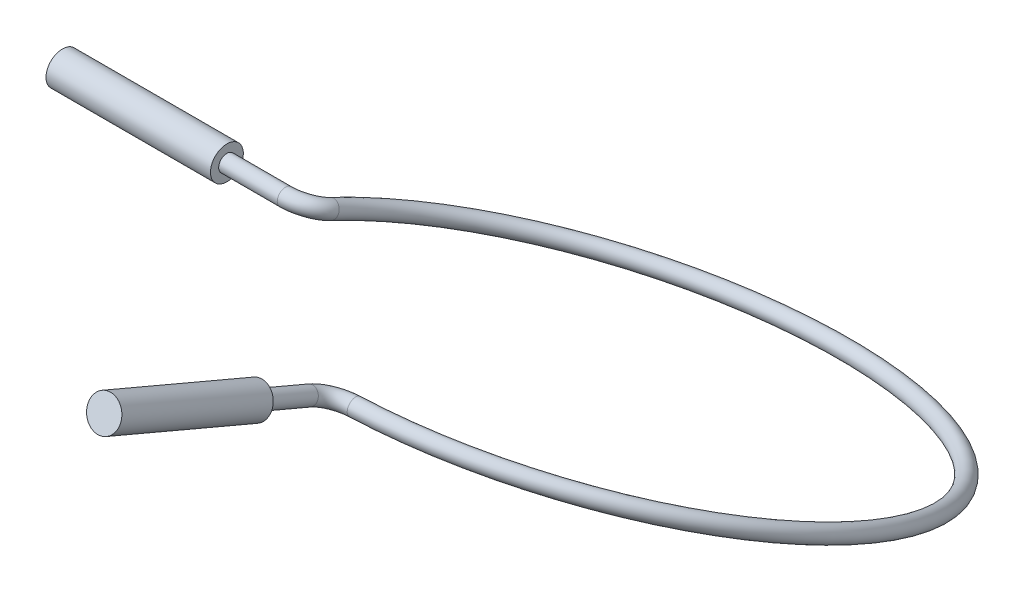
ISO-10303-21;
HEADER;
FILE_DESCRIPTION(('STEP AP214'),'2;1');
FILE_NAME('part.step','',(''),(''),'','','');
FILE_SCHEMA(('AUTOMOTIVE_DESIGN { 1 0 10303 214 1 1 1 1 }'));
ENDSEC;
DATA;
#1=APPLICATION_CONTEXT('core data for automotive mechanical design processes');
#2=APPLICATION_PROTOCOL_DEFINITION('international standard','automotive_design',2000,#1);
#3=PRODUCT_CONTEXT('',#1,'mechanical');
#4=PRODUCT('Part','Part','',(#3));
#5=PRODUCT_RELATED_PRODUCT_CATEGORY('part','',(#4));
#6=PRODUCT_DEFINITION_FORMATION('','',#4);
#7=PRODUCT_DEFINITION_CONTEXT('part definition',#1,'design');
#8=PRODUCT_DEFINITION('design','',#6,#7);
#9=PRODUCT_DEFINITION_SHAPE('','',#8);
#10=(LENGTH_UNIT() NAMED_UNIT(*) SI_UNIT(.MILLI.,.METRE.));
#11=(NAMED_UNIT(*) PLANE_ANGLE_UNIT() SI_UNIT($,.RADIAN.));
#12=(NAMED_UNIT(*) SI_UNIT($,.STERADIAN.) SOLID_ANGLE_UNIT());
#13=UNCERTAINTY_MEASURE_WITH_UNIT(LENGTH_MEASURE(1.E-05),#10,'distance_accuracy_value','');
#14=(GEOMETRIC_REPRESENTATION_CONTEXT(3) GLOBAL_UNCERTAINTY_ASSIGNED_CONTEXT((#13)) GLOBAL_UNIT_ASSIGNED_CONTEXT((#10,
#11,#12)) REPRESENTATION_CONTEXT('',''));
#15=CARTESIAN_POINT('',(0.,0.,0.));
#16=DIRECTION('',(0.,0.,1.));
#17=DIRECTION('',(1.,0.,0.));
#18=AXIS2_PLACEMENT_3D('',#15,#16,#17);
#19=CARTESIAN_POINT('',(-36.7708609577545,-92.2167493659821,300.912723344593));
#20=DIRECTION('',(-1.,0.,0.));
#21=DIRECTION('',(0.,0.,1.));
#22=AXIS2_PLACEMENT_3D('',#19,#20,#21);
#23=CYLINDRICAL_SURFACE('',#22,1.);
#24=CARTESIAN_POINT('',(-36.7708609577544,-92.2167493659821,300.912723344593));
#25=DIRECTION('',(1.,0.,0.));
#26=DIRECTION('',(0.,0.,-1.));
#27=AXIS2_PLACEMENT_3D('',#24,#25,#26);
#28=CIRCLE('',#27,1.);
#29=CARTESIAN_POINT('',(-36.7708609577543,-91.8260182374928,301.833228198046));
#30=VERTEX_POINT('',#29);
#31=EDGE_CURVE('E50',#30,#30,#28,.T.);
#32=ORIENTED_EDGE('',*,*,#31,.F.);
#33=EDGE_LOOP('',(#32));
#34=FACE_BOUND('',#33,.T.);
#35=CARTESIAN_POINT('',(-43.8930374945532,-92.2167493659821,300.912723344593));
#36=DIRECTION('',(-1.,0.,0.));
#37=DIRECTION('',(0.,0.,1.));
#38=AXIS2_PLACEMENT_3D('',#35,#36,#37);
#39=CIRCLE('',#38,1.);
#40=CARTESIAN_POINT('',(-43.8930374945532,-92.2167493659821,301.912723344593));
#41=VERTEX_POINT('',#40);
#42=EDGE_CURVE('E10',#41,#41,#39,.T.);
#43=ORIENTED_EDGE('',*,*,#42,.F.);
#44=EDGE_LOOP('',(#43));
#45=FACE_BOUND('',#44,.T.);
#46=ADVANCED_FACE('F39',(#34,#45),#23,.T.);
#47=CARTESIAN_POINT('',(-1.38777878078145E-13,-67.2517507231281,359.726574460148));
#48=DIRECTION('',(0.,-0.390731128489272,-0.920504853452441));
#49=DIRECTION('',(0.,0.920504853452441,-0.390731128489272));
#50=AXIS2_PLACEMENT_3D('',#47,#48,#49);
#51=CYLINDRICAL_SURFACE('',#50,1.);
#52=CARTESIAN_POINT('',(-2.77555756156289E-13,-77.8492293684367,334.760479321831));
#53=DIRECTION('',(0.,0.390731128489272,0.920504853452441));
#54=DIRECTION('',(0.920504853452441,0.359669900169322,-0.152670814770504));
#55=AXIS2_PLACEMENT_3D('',#52,#53,#54);
#56=CIRCLE('',#55,1.);
#57=CARTESIAN_POINT('',(-1.00000000000028,-77.8492293684368,334.760479321831));
#58=VERTEX_POINT('',#57);
#59=EDGE_CURVE('E62',#58,#58,#56,.T.);
#60=ORIENTED_EDGE('',*,*,#59,.T.);
#61=EDGE_LOOP('',(#60));
#62=FACE_BOUND('',#61,.T.);
#63=CARTESIAN_POINT('',(-2.41185599609037E-13,-75.0663732929135,341.316477391099));
#64=DIRECTION('',(0.,0.390731128489272,0.920504853452441));
#65=DIRECTION('',(0.,-0.920504853452441,0.390731128489272));
#66=AXIS2_PLACEMENT_3D('',#63,#64,#65);
#67=CIRCLE('',#66,1.);
#68=CARTESIAN_POINT('',(-2.41185599609037E-13,-75.986878146366,341.707208519588));
#69=VERTEX_POINT('',#68);
#70=EDGE_CURVE('E46',#69,#69,#67,.T.);
#71=ORIENTED_EDGE('',*,*,#70,.F.);
#72=EDGE_LOOP('',(#71));
#73=FACE_BOUND('',#72,.T.);
#74=ADVANCED_FACE('F94',(#62,#73),#51,.T.);
#75=CARTESIAN_POINT('',(2.99999999999975,-77.8492293684367,334.760479321831));
#76=DIRECTION('',(0.,-0.920504853452441,0.390731128489272));
#77=DIRECTION('',(0.,-0.390731128489272,-0.920504853452441));
#78=AXIS2_PLACEMENT_3D('',#75,#76,#77);
#79=TOROIDAL_SURFACE('',#78,3.00000000000003,1.);
#80=CARTESIAN_POINT('',(2.75605153136717,-79.0175408689198,332.008109909399));
#81=DIRECTION('',(-0.996688357882789,0.0317727534806798,0.0748519164561933));
#82=DIRECTION('',(0.0748519164561938,0.718148702348954,0.691852319442053));
#83=AXIS2_PLACEMENT_3D('',#80,#81,#82);
#84=CIRCLE('',#83,1.);
#85=CARTESIAN_POINT('',(2.67473537515632,-79.4069780357474,331.090653438588));
#86=VERTEX_POINT('',#85);
#87=EDGE_CURVE('E59',#86,#86,#84,.T.);
#88=CARTESIAN_POINT('',(2.99999999999975,-77.8492293684367,334.760479321831));
#89=DIRECTION('',(0.,-0.920504853452441,0.390731128489272));
#90=DIRECTION('',(0.,-0.390731128489272,-0.920504853452441));
#91=AXIS2_PLACEMENT_3D('',#88,#89,#90);
#92=CIRCLE('',#91,4.00000000000003);
#93=EDGE_CURVE('',#58,#86,#92,.T.);
#94=ORIENTED_EDGE('',*,*,#59,.F.);
#95=ORIENTED_EDGE('',*,*,#87,.T.);
#96=ORIENTED_EDGE('',*,*,#93,.T.);
#97=ORIENTED_EDGE('',*,*,#93,.F.);
#98=EDGE_LOOP('',(#94,#96,#95,#97));
#99=FACE_BOUND('',#98,.T.);
#100=ADVANCED_FACE('F101',(#99),#79,.T.);
#101=CARTESIAN_POINT('',(-4.16767315103428E-13,-92.2167493659821,300.912723344593));
#102=DIRECTION('',(0.,0.920504853452441,-0.390731128489272));
#103=DIRECTION('',(0.,0.390731128489272,0.920504853452441));
#104=AXIS2_PLACEMENT_3D('',#101,#102,#103);
#105=TOROIDAL_SURFACE('',#104,33.8930374945528,1.);
#106=CARTESIAN_POINT('',(-33.7807958841061,-93.2936244910079,298.375764533604));
#107=DIRECTION('',(0.0813161562108567,-0.389437166827661,-0.917456470810651));
#108=DIRECTION('',(-0.917456470810651,0.330422926382812,-0.22157236715864));
#109=AXIS2_PLACEMENT_3D('',#106,#107,#108);
#110=CIRCLE('',#109,1.);
#111=CARTESIAN_POINT('',(-32.7841075262233,-93.2618517375272,298.45061645006));
#112=VERTEX_POINT('',#111);
#113=EDGE_CURVE('E54',#112,#112,#110,.T.);
#114=ORIENTED_EDGE('',*,*,#113,.T.);
#115=EDGE_LOOP('',(#114));
#116=FACE_BOUND('',#115,.T.);
#117=ORIENTED_EDGE('',*,*,#87,.F.);
#118=EDGE_LOOP('',(#117));
#119=FACE_BOUND('',#118,.T.);
#120=ADVANCED_FACE('F111',(#116,#119),#105,.T.);
#121=CARTESIAN_POINT('',(-36.7708609577545,-93.3889427514499,298.151208784236));
#122=DIRECTION('',(0.,-0.920504853452441,0.390731128489272));
#123=DIRECTION('',(0.,-0.390731128489272,-0.920504853452441));
#124=AXIS2_PLACEMENT_3D('',#121,#122,#123);
#125=TOROIDAL_SURFACE('',#124,3.00000000000001,1.);
#126=CARTESIAN_POINT('',(-36.7708609577545,-93.3889427514499,298.151208784236));
#127=DIRECTION('',(0.,-0.920504853452441,0.390731128489272));
#128=DIRECTION('',(0.,-0.390731128489272,-0.920504853452441));
#129=AXIS2_PLACEMENT_3D('',#126,#127,#128);
#130=CIRCLE('',#129,4.00000000000001);
#131=EDGE_CURVE('',#112,#30,#130,.T.);
#132=ORIENTED_EDGE('',*,*,#113,.F.);
#133=ORIENTED_EDGE('',*,*,#31,.T.);
#134=ORIENTED_EDGE('',*,*,#131,.T.);
#135=ORIENTED_EDGE('',*,*,#131,.F.);
#136=EDGE_LOOP('',(#132,#134,#133,#135));
#137=FACE_BOUND('',#136,.T.);
#138=ADVANCED_FACE('F104',(#137),#125,.T.);
#139=CARTESIAN_POINT('',(-2.41185599609037E-13,-75.0663732929136,341.316477391099));
#140=DIRECTION('',(0.,0.390731128489272,0.920504853452441));
#141=DIRECTION('',(0.,-0.920504853452441,0.390731128489272));
#142=AXIS2_PLACEMENT_3D('',#139,#140,#141);
#143=CYLINDRICAL_SURFACE('',#142,2.);
#144=CARTESIAN_POINT('',(-2.41185599609037E-13,-75.0663732929136,341.316477391099));
#145=DIRECTION('',(0.,0.390731128489272,0.920504853452441));
#146=DIRECTION('',(1.,0.,0.));
#147=AXIS2_PLACEMENT_3D('',#144,#145,#146);
#148=CIRCLE('',#147,2.);
#149=CARTESIAN_POINT('',(1.99999999999976,-75.0663732929136,341.316477391099));
#150=VERTEX_POINT('',#149);
#151=EDGE_CURVE('E65',#150,#150,#148,.T.);
#152=ORIENTED_EDGE('',*,*,#151,.T.);
#153=EDGE_LOOP('',(#152));
#154=FACE_BOUND('',#153,.T.);
#155=CARTESIAN_POINT('',(-1.38777878078144E-13,-67.2517507231282,359.726574460148));
#156=DIRECTION('',(0.,0.390731128489272,0.920504853452441));
#157=DIRECTION('',(1.,0.,0.));
#158=AXIS2_PLACEMENT_3D('',#155,#156,#157);
#159=CIRCLE('',#158,2.);
#160=CARTESIAN_POINT('',(1.99999999999986,-67.2517507231282,359.726574460148));
#161=VERTEX_POINT('',#160);
#162=EDGE_CURVE('E66',#161,#161,#159,.T.);
#163=ORIENTED_EDGE('',*,*,#162,.F.);
#164=EDGE_LOOP('',(#163));
#165=FACE_BOUND('',#164,.T.);
#166=ADVANCED_FACE('F110',(#154,#165),#143,.T.);
#167=CARTESIAN_POINT('',(-2.41185599609037E-13,-75.0663732929136,341.316477391099));
#168=DIRECTION('',(0.,0.390731128489272,0.920504853452441));
#169=DIRECTION('',(0.,-0.920504853452441,0.390731128489272));
#170=AXIS2_PLACEMENT_3D('',#167,#168,#169);
#171=PLANE('',#170);
#172=ORIENTED_EDGE('',*,*,#70,.T.);
#173=EDGE_LOOP('',(#172));
#174=FACE_BOUND('',#173,.T.);
#175=ORIENTED_EDGE('',*,*,#151,.F.);
#176=EDGE_LOOP('',(#175));
#177=FACE_BOUND('',#176,.T.);
#178=ADVANCED_FACE('F121',(#174,#177),#171,.F.);
#179=CARTESIAN_POINT('',(-1.38777878078145E-13,-67.2517507231281,359.726574460148));
#180=DIRECTION('',(0.,0.390731128489272,0.920504853452441));
#181=DIRECTION('',(0.920504853452441,0.359669900169322,-0.152670814770504));
#182=AXIS2_PLACEMENT_3D('',#179,#180,#181);
#183=PLANE('',#182);
#184=ORIENTED_EDGE('',*,*,#162,.T.);
#185=EDGE_LOOP('',(#184));
#186=FACE_BOUND('',#185,.T.);
#187=ADVANCED_FACE('F41',(#186),#183,.T.);
#188=CARTESIAN_POINT('',(-43.8930374945532,-92.2167493659821,300.912723344593));
#189=DIRECTION('',(-1.,0.,0.));
#190=DIRECTION('',(0.,0.,1.));
#191=AXIS2_PLACEMENT_3D('',#188,#189,#190);
#192=CYLINDRICAL_SURFACE('',#191,2.);
#193=CARTESIAN_POINT('',(-43.8930374945532,-92.2167493659821,300.912723344593));
#194=DIRECTION('',(-1.,0.,0.));
#195=DIRECTION('',(0.,0.,1.));
#196=AXIS2_PLACEMENT_3D('',#193,#194,#195);
#197=CIRCLE('',#196,2.);
#198=CARTESIAN_POINT('',(-43.8930374945532,-92.2167493659821,302.912723344593));
#199=VERTEX_POINT('',#198);
#200=EDGE_CURVE('E69',#199,#199,#197,.T.);
#201=ORIENTED_EDGE('',*,*,#200,.T.);
#202=EDGE_LOOP('',(#201));
#203=FACE_BOUND('',#202,.T.);
#204=CARTESIAN_POINT('',(-63.8930374945532,-92.2167493659821,300.912723344593));
#205=DIRECTION('',(-1.,0.,0.));
#206=DIRECTION('',(0.,0.,1.));
#207=AXIS2_PLACEMENT_3D('',#204,#205,#206);
#208=CIRCLE('',#207,2.);
#209=CARTESIAN_POINT('',(-63.8930374945532,-92.2167493659821,302.912723344593));
#210=VERTEX_POINT('',#209);
#211=EDGE_CURVE('E72',#210,#210,#208,.T.);
#212=ORIENTED_EDGE('',*,*,#211,.F.);
#213=EDGE_LOOP('',(#212));
#214=FACE_BOUND('',#213,.T.);
#215=ADVANCED_FACE('F78',(#203,#214),#192,.T.);
#216=CARTESIAN_POINT('',(-43.8930374945532,-92.2167493659821,300.912723344593));
#217=DIRECTION('',(-1.,0.,0.));
#218=DIRECTION('',(0.,0.,1.));
#219=AXIS2_PLACEMENT_3D('',#216,#217,#218);
#220=PLANE('',#219);
#221=ORIENTED_EDGE('',*,*,#42,.T.);
#222=EDGE_LOOP('',(#221));
#223=FACE_BOUND('',#222,.T.);
#224=ORIENTED_EDGE('',*,*,#200,.F.);
#225=EDGE_LOOP('',(#224));
#226=FACE_BOUND('',#225,.T.);
#227=ADVANCED_FACE('F81',(#223,#226),#220,.F.);
#228=CARTESIAN_POINT('',(-63.8930374945532,-92.2167493659821,300.912723344593));
#229=DIRECTION('',(1.,0.,0.));
#230=DIRECTION('',(0.,0.,-1.));
#231=AXIS2_PLACEMENT_3D('',#228,#229,#230);
#232=PLANE('',#231);
#233=ORIENTED_EDGE('',*,*,#211,.T.);
#234=EDGE_LOOP('',(#233));
#235=FACE_BOUND('',#234,.T.);
#236=ADVANCED_FACE('F83',(#235),#232,.F.);
#237=CLOSED_SHELL('',(#46,#74,#100,#120,#138,#166,#178,#187,#215,#227,#236));
#238=MANIFOLD_SOLID_BREP('B2',#237);
#239=ADVANCED_BREP_SHAPE_REPRESENTATION('',(#18,#238),#14);
#240=SHAPE_DEFINITION_REPRESENTATION(#9,#239);
ENDSEC;
END-ISO-10303-21;
